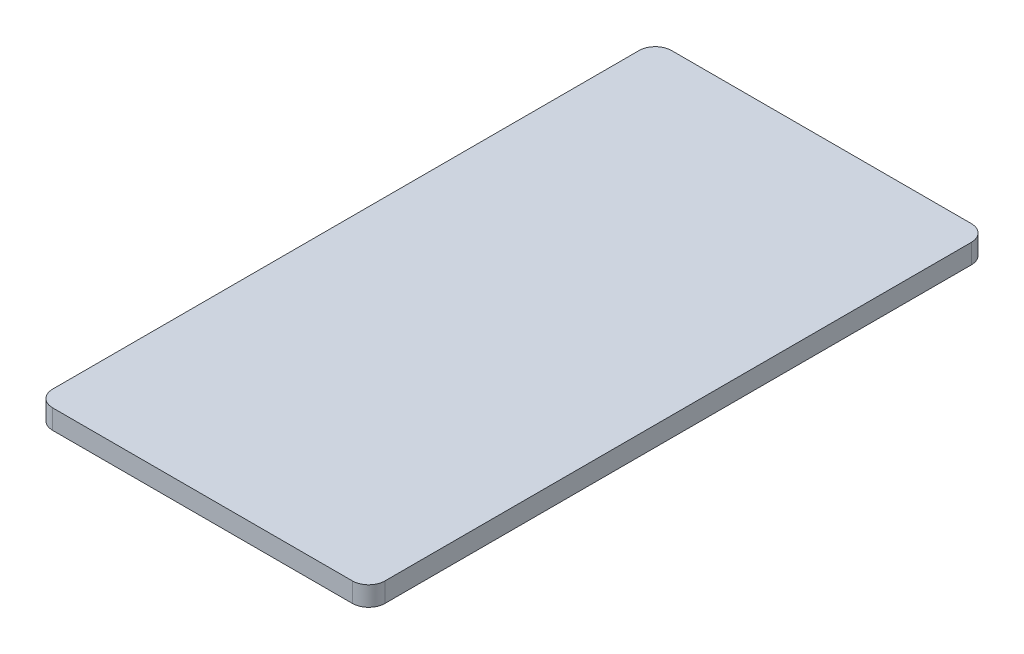
ISO-10303-21;
HEADER;
FILE_DESCRIPTION(('STEP AP214'),'2;1');
FILE_NAME('part.step','',(''),(''),'','','');
FILE_SCHEMA(('AUTOMOTIVE_DESIGN { 1 0 10303 214 1 1 1 1 }'));
ENDSEC;
DATA;
#1=APPLICATION_CONTEXT('core data for automotive mechanical design processes');
#2=APPLICATION_PROTOCOL_DEFINITION('international standard','automotive_design',2000,#1);
#3=PRODUCT_CONTEXT('',#1,'mechanical');
#4=PRODUCT('Part','Part','',(#3));
#5=PRODUCT_RELATED_PRODUCT_CATEGORY('part','',(#4));
#6=PRODUCT_DEFINITION_FORMATION('','',#4);
#7=PRODUCT_DEFINITION_CONTEXT('part definition',#1,'design');
#8=PRODUCT_DEFINITION('design','',#6,#7);
#9=PRODUCT_DEFINITION_SHAPE('','',#8);
#10=(LENGTH_UNIT() NAMED_UNIT(*) SI_UNIT(.MILLI.,.METRE.));
#11=(NAMED_UNIT(*) PLANE_ANGLE_UNIT() SI_UNIT($,.RADIAN.));
#12=(NAMED_UNIT(*) SI_UNIT($,.STERADIAN.) SOLID_ANGLE_UNIT());
#13=UNCERTAINTY_MEASURE_WITH_UNIT(LENGTH_MEASURE(1.E-05),#10,'distance_accuracy_value','');
#14=(GEOMETRIC_REPRESENTATION_CONTEXT(3) GLOBAL_UNCERTAINTY_ASSIGNED_CONTEXT((#13)) GLOBAL_UNIT_ASSIGNED_CONTEXT((#10,
#11,#12)) REPRESENTATION_CONTEXT('',''));
#15=CARTESIAN_POINT('',(0.,0.,0.));
#16=DIRECTION('',(0.,0.,1.));
#17=DIRECTION('',(1.,0.,0.));
#18=AXIS2_PLACEMENT_3D('',#15,#16,#17);
#19=CARTESIAN_POINT('',(9.4,3.8,-14.));
#20=DIRECTION('',(0.,-1.,0.));
#21=DIRECTION('',(0.,0.,-1.));
#22=AXIS2_PLACEMENT_3D('',#19,#20,#21);
#23=CYLINDRICAL_SURFACE('',#22,0.999999999999999);
#24=CARTESIAN_POINT('',(9.4,2.6,-14.));
#25=DIRECTION('',(0.,-1.,0.));
#26=DIRECTION('',(0.,0.,-1.));
#27=AXIS2_PLACEMENT_3D('',#24,#25,#26);
#28=CIRCLE('',#27,0.999999999999999);
#29=CARTESIAN_POINT('',(9.4,2.6,-15.));
#30=VERTEX_POINT('',#29);
#31=CARTESIAN_POINT('',(10.4,2.6,-14.));
#32=VERTEX_POINT('',#31);
#33=EDGE_CURVE('E132',#30,#32,#28,.T.);
#34=ORIENTED_EDGE('',*,*,#33,.F.);
#35=DIRECTION('',(0.,-1.,0.));
#36=VECTOR('',#35,1.);
#37=CARTESIAN_POINT('',(9.4,3.8,-15.));
#38=LINE('',#37,#36);
#39=CARTESIAN_POINT('',(9.4,3.8,-15.));
#40=VERTEX_POINT('',#39);
#41=EDGE_CURVE('E11',#40,#30,#38,.T.);
#42=ORIENTED_EDGE('',*,*,#41,.F.);
#43=CARTESIAN_POINT('',(9.4,3.8,-14.));
#44=DIRECTION('',(0.,-1.,0.));
#45=DIRECTION('',(0.,0.,-1.));
#46=AXIS2_PLACEMENT_3D('',#43,#44,#45);
#47=CIRCLE('',#46,0.999999999999999);
#48=CARTESIAN_POINT('',(10.4,3.8,-14.));
#49=VERTEX_POINT('',#48);
#50=EDGE_CURVE('E152',#40,#49,#47,.T.);
#51=ORIENTED_EDGE('',*,*,#50,.T.);
#52=DIRECTION('',(0.,-1.,0.));
#53=VECTOR('',#52,1.);
#54=CARTESIAN_POINT('',(10.4,3.8,-14.));
#55=LINE('',#54,#53);
#56=EDGE_CURVE('E38',#49,#32,#55,.T.);
#57=ORIENTED_EDGE('',*,*,#56,.T.);
#58=EDGE_LOOP('',(#34,#42,#51,#57));
#59=FACE_BOUND('',#58,.T.);
#60=ADVANCED_FACE('F35',(#59),#23,.T.);
#61=CARTESIAN_POINT('',(-9.,3.8,-15.));
#62=DIRECTION('',(0.,0.,-1.));
#63=DIRECTION('',(-1.,0.,0.));
#64=AXIS2_PLACEMENT_3D('',#61,#62,#63);
#65=PLANE('',#64);
#66=DIRECTION('',(1.,0.,0.));
#67=VECTOR('',#66,1.);
#68=CARTESIAN_POINT('',(-9.,2.6,-15.));
#69=LINE('',#68,#67);
#70=CARTESIAN_POINT('',(-9.,2.6,-15.));
#71=VERTEX_POINT('',#70);
#72=EDGE_CURVE('E150',#71,#30,#69,.T.);
#73=ORIENTED_EDGE('',*,*,#72,.F.);
#74=DIRECTION('',(0.,-1.,0.));
#75=VECTOR('',#74,1.);
#76=CARTESIAN_POINT('',(-9.,3.8,-15.));
#77=LINE('',#76,#75);
#78=CARTESIAN_POINT('',(-9.,3.8,-15.));
#79=VERTEX_POINT('',#78);
#80=EDGE_CURVE('E44',#79,#71,#77,.T.);
#81=ORIENTED_EDGE('',*,*,#80,.F.);
#82=DIRECTION('',(1.,0.,0.));
#83=VECTOR('',#82,1.);
#84=CARTESIAN_POINT('',(-9.,3.8,-15.));
#85=LINE('',#84,#83);
#86=EDGE_CURVE('E122',#79,#40,#85,.T.);
#87=ORIENTED_EDGE('',*,*,#86,.T.);
#88=ORIENTED_EDGE('',*,*,#41,.T.);
#89=EDGE_LOOP('',(#73,#81,#87,#88));
#90=FACE_BOUND('',#89,.T.);
#91=ADVANCED_FACE('F164',(#90),#65,.T.);
#92=CARTESIAN_POINT('',(-9.,3.8,-14.));
#93=DIRECTION('',(0.,-1.,0.));
#94=DIRECTION('',(0.,0.,-1.));
#95=AXIS2_PLACEMENT_3D('',#92,#93,#94);
#96=CYLINDRICAL_SURFACE('',#95,0.999999999999997);
#97=CARTESIAN_POINT('',(-9.,2.6,-14.));
#98=DIRECTION('',(0.,-1.,0.));
#99=DIRECTION('',(0.,0.,-1.));
#100=AXIS2_PLACEMENT_3D('',#97,#98,#99);
#101=CIRCLE('',#100,0.999999999999997);
#102=CARTESIAN_POINT('',(-10.,2.6,-14.));
#103=VERTEX_POINT('',#102);
#104=EDGE_CURVE('E109',#103,#71,#101,.T.);
#105=ORIENTED_EDGE('',*,*,#104,.F.);
#106=DIRECTION('',(0.,-1.,0.));
#107=VECTOR('',#106,1.);
#108=CARTESIAN_POINT('',(-10.,3.8,-14.));
#109=LINE('',#108,#107);
#110=CARTESIAN_POINT('',(-10.,3.8,-14.));
#111=VERTEX_POINT('',#110);
#112=EDGE_CURVE('E104',#111,#103,#109,.T.);
#113=ORIENTED_EDGE('',*,*,#112,.F.);
#114=CARTESIAN_POINT('',(-9.,3.8,-14.));
#115=DIRECTION('',(0.,-1.,0.));
#116=DIRECTION('',(0.,0.,-1.));
#117=AXIS2_PLACEMENT_3D('',#114,#115,#116);
#118=CIRCLE('',#117,0.999999999999997);
#119=EDGE_CURVE('E107',#111,#79,#118,.T.);
#120=ORIENTED_EDGE('',*,*,#119,.T.);
#121=ORIENTED_EDGE('',*,*,#80,.T.);
#122=EDGE_LOOP('',(#105,#113,#120,#121));
#123=FACE_BOUND('',#122,.T.);
#124=ADVANCED_FACE('F106',(#123),#96,.T.);
#125=CARTESIAN_POINT('',(-10.,3.8,22.));
#126=DIRECTION('',(-1.,0.,0.));
#127=DIRECTION('',(0.,0.,1.));
#128=AXIS2_PLACEMENT_3D('',#125,#126,#127);
#129=PLANE('',#128);
#130=DIRECTION('',(0.,0.,-1.));
#131=VECTOR('',#130,1.);
#132=CARTESIAN_POINT('',(-10.,2.6,22.));
#133=LINE('',#132,#131);
#134=CARTESIAN_POINT('',(-10.,2.6,22.));
#135=VERTEX_POINT('',#134);
#136=EDGE_CURVE('E147',#135,#103,#133,.T.);
#137=ORIENTED_EDGE('',*,*,#136,.F.);
#138=DIRECTION('',(0.,-1.,0.));
#139=VECTOR('',#138,1.);
#140=CARTESIAN_POINT('',(-10.,3.8,22.));
#141=LINE('',#140,#139);
#142=CARTESIAN_POINT('',(-10.,3.8,22.));
#143=VERTEX_POINT('',#142);
#144=EDGE_CURVE('E114',#143,#135,#141,.T.);
#145=ORIENTED_EDGE('',*,*,#144,.F.);
#146=DIRECTION('',(0.,0.,-1.));
#147=VECTOR('',#146,1.);
#148=CARTESIAN_POINT('',(-10.,3.8,22.));
#149=LINE('',#148,#147);
#150=EDGE_CURVE('E120',#143,#111,#149,.T.);
#151=ORIENTED_EDGE('',*,*,#150,.T.);
#152=ORIENTED_EDGE('',*,*,#112,.T.);
#153=EDGE_LOOP('',(#137,#145,#151,#152));
#154=FACE_BOUND('',#153,.T.);
#155=ADVANCED_FACE('F124',(#154),#129,.T.);
#156=CARTESIAN_POINT('',(-9.,3.8,22.));
#157=DIRECTION('',(0.,-1.,0.));
#158=DIRECTION('',(0.,0.,-1.));
#159=AXIS2_PLACEMENT_3D('',#156,#157,#158);
#160=CYLINDRICAL_SURFACE('',#159,1.);
#161=CARTESIAN_POINT('',(-9.,2.6,22.));
#162=DIRECTION('',(0.,-1.,0.));
#163=DIRECTION('',(0.,0.,-1.));
#164=AXIS2_PLACEMENT_3D('',#161,#162,#163);
#165=CIRCLE('',#164,1.);
#166=CARTESIAN_POINT('',(-9.,2.6,23.));
#167=VERTEX_POINT('',#166);
#168=EDGE_CURVE('E144',#167,#135,#165,.T.);
#169=ORIENTED_EDGE('',*,*,#168,.F.);
#170=DIRECTION('',(0.,-1.,0.));
#171=VECTOR('',#170,1.);
#172=CARTESIAN_POINT('',(-9.,3.8,23.));
#173=LINE('',#172,#171);
#174=CARTESIAN_POINT('',(-9.,3.8,23.));
#175=VERTEX_POINT('',#174);
#176=EDGE_CURVE('E156',#175,#167,#173,.T.);
#177=ORIENTED_EDGE('',*,*,#176,.F.);
#178=CARTESIAN_POINT('',(-9.,3.8,22.));
#179=DIRECTION('',(0.,-1.,0.));
#180=DIRECTION('',(0.,0.,-1.));
#181=AXIS2_PLACEMENT_3D('',#178,#179,#180);
#182=CIRCLE('',#181,1.);
#183=EDGE_CURVE('E125',#175,#143,#182,.T.);
#184=ORIENTED_EDGE('',*,*,#183,.T.);
#185=ORIENTED_EDGE('',*,*,#144,.T.);
#186=EDGE_LOOP('',(#169,#177,#184,#185));
#187=FACE_BOUND('',#186,.T.);
#188=ADVANCED_FACE('F177',(#187),#160,.T.);
#189=CARTESIAN_POINT('',(9.4,3.8,23.));
#190=DIRECTION('',(0.,0.,1.));
#191=DIRECTION('',(1.,0.,0.));
#192=AXIS2_PLACEMENT_3D('',#189,#190,#191);
#193=PLANE('',#192);
#194=DIRECTION('',(-1.,0.,0.));
#195=VECTOR('',#194,1.);
#196=CARTESIAN_POINT('',(9.4,2.6,23.));
#197=LINE('',#196,#195);
#198=CARTESIAN_POINT('',(9.4,2.6,23.));
#199=VERTEX_POINT('',#198);
#200=EDGE_CURVE('E141',#199,#167,#197,.T.);
#201=ORIENTED_EDGE('',*,*,#200,.F.);
#202=DIRECTION('',(0.,-1.,0.));
#203=VECTOR('',#202,1.);
#204=CARTESIAN_POINT('',(9.4,3.8,23.));
#205=LINE('',#204,#203);
#206=CARTESIAN_POINT('',(9.4,3.8,23.));
#207=VERTEX_POINT('',#206);
#208=EDGE_CURVE('E158',#207,#199,#205,.T.);
#209=ORIENTED_EDGE('',*,*,#208,.F.);
#210=DIRECTION('',(-1.,0.,0.));
#211=VECTOR('',#210,1.);
#212=CARTESIAN_POINT('',(9.4,3.8,23.));
#213=LINE('',#212,#211);
#214=EDGE_CURVE('E127',#207,#175,#213,.T.);
#215=ORIENTED_EDGE('',*,*,#214,.T.);
#216=ORIENTED_EDGE('',*,*,#176,.T.);
#217=EDGE_LOOP('',(#201,#209,#215,#216));
#218=FACE_BOUND('',#217,.T.);
#219=ADVANCED_FACE('F180',(#218),#193,.T.);
#220=CARTESIAN_POINT('',(9.4,3.8,22.));
#221=DIRECTION('',(0.,-1.,0.));
#222=DIRECTION('',(0.,0.,-1.));
#223=AXIS2_PLACEMENT_3D('',#220,#221,#222);
#224=CYLINDRICAL_SURFACE('',#223,1.);
#225=CARTESIAN_POINT('',(9.4,2.6,22.));
#226=DIRECTION('',(0.,-1.,0.));
#227=DIRECTION('',(0.,0.,-1.));
#228=AXIS2_PLACEMENT_3D('',#225,#226,#227);
#229=CIRCLE('',#228,1.);
#230=CARTESIAN_POINT('',(10.4,2.6,22.));
#231=VERTEX_POINT('',#230);
#232=EDGE_CURVE('E138',#231,#199,#229,.T.);
#233=ORIENTED_EDGE('',*,*,#232,.F.);
#234=DIRECTION('',(0.,-1.,0.));
#235=VECTOR('',#234,1.);
#236=CARTESIAN_POINT('',(10.4,3.8,22.));
#237=LINE('',#236,#235);
#238=CARTESIAN_POINT('',(10.4,3.8,22.));
#239=VERTEX_POINT('',#238);
#240=EDGE_CURVE('E159',#239,#231,#237,.T.);
#241=ORIENTED_EDGE('',*,*,#240,.F.);
#242=CARTESIAN_POINT('',(9.4,3.8,22.));
#243=DIRECTION('',(0.,-1.,0.));
#244=DIRECTION('',(0.,0.,-1.));
#245=AXIS2_PLACEMENT_3D('',#242,#243,#244);
#246=CIRCLE('',#245,1.);
#247=EDGE_CURVE('E255',#239,#207,#246,.T.);
#248=ORIENTED_EDGE('',*,*,#247,.T.);
#249=ORIENTED_EDGE('',*,*,#208,.T.);
#250=EDGE_LOOP('',(#233,#241,#248,#249));
#251=FACE_BOUND('',#250,.T.);
#252=ADVANCED_FACE('F184',(#251),#224,.T.);
#253=CARTESIAN_POINT('',(10.4,3.8,-14.));
#254=DIRECTION('',(1.,0.,0.));
#255=DIRECTION('',(0.,0.,-1.));
#256=AXIS2_PLACEMENT_3D('',#253,#254,#255);
#257=PLANE('',#256);
#258=DIRECTION('',(0.,0.,1.));
#259=VECTOR('',#258,1.);
#260=CARTESIAN_POINT('',(10.4,2.6,-14.));
#261=LINE('',#260,#259);
#262=EDGE_CURVE('E135',#32,#231,#261,.T.);
#263=ORIENTED_EDGE('',*,*,#262,.F.);
#264=ORIENTED_EDGE('',*,*,#56,.F.);
#265=DIRECTION('',(0.,0.,1.));
#266=VECTOR('',#265,1.);
#267=CARTESIAN_POINT('',(10.4,3.8,-14.));
#268=LINE('',#267,#266);
#269=EDGE_CURVE('E256',#49,#239,#268,.T.);
#270=ORIENTED_EDGE('',*,*,#269,.T.);
#271=ORIENTED_EDGE('',*,*,#240,.T.);
#272=EDGE_LOOP('',(#263,#264,#270,#271));
#273=FACE_BOUND('',#272,.T.);
#274=ADVANCED_FACE('F161',(#273),#257,.T.);
#275=CARTESIAN_POINT('',(9.4,3.8,-14.));
#276=DIRECTION('',(0.,-1.,0.));
#277=DIRECTION('',(0.,0.,-1.));
#278=AXIS2_PLACEMENT_3D('',#275,#276,#277);
#279=PLANE('',#278);
#280=ORIENTED_EDGE('',*,*,#50,.F.);
#281=ORIENTED_EDGE('',*,*,#86,.F.);
#282=ORIENTED_EDGE('',*,*,#119,.F.);
#283=ORIENTED_EDGE('',*,*,#150,.F.);
#284=ORIENTED_EDGE('',*,*,#183,.F.);
#285=ORIENTED_EDGE('',*,*,#214,.F.);
#286=ORIENTED_EDGE('',*,*,#247,.F.);
#287=ORIENTED_EDGE('',*,*,#269,.F.);
#288=EDGE_LOOP('',(#280,#281,#282,#283,#284,#285,#286,#287));
#289=FACE_BOUND('',#288,.T.);
#290=ADVANCED_FACE('F118',(#289),#279,.F.);
#291=CARTESIAN_POINT('',(9.4,2.6,-14.));
#292=DIRECTION('',(0.,-1.,0.));
#293=DIRECTION('',(0.,0.,-1.));
#294=AXIS2_PLACEMENT_3D('',#291,#292,#293);
#295=PLANE('',#294);
#296=ORIENTED_EDGE('',*,*,#33,.T.);
#297=ORIENTED_EDGE('',*,*,#262,.T.);
#298=ORIENTED_EDGE('',*,*,#232,.T.);
#299=ORIENTED_EDGE('',*,*,#200,.T.);
#300=ORIENTED_EDGE('',*,*,#168,.T.);
#301=ORIENTED_EDGE('',*,*,#136,.T.);
#302=ORIENTED_EDGE('',*,*,#104,.T.);
#303=ORIENTED_EDGE('',*,*,#72,.T.);
#304=EDGE_LOOP('',(#296,#297,#298,#299,#300,#301,#302,#303));
#305=FACE_BOUND('',#304,.T.);
#306=ADVANCED_FACE('F163',(#305),#295,.T.);
#307=CLOSED_SHELL('',(#60,#91,#124,#155,#188,#219,#252,#274,#290,#306));
#308=MANIFOLD_SOLID_BREP('B2',#307);
#309=ADVANCED_BREP_SHAPE_REPRESENTATION('',(#18,#308),#14);
#310=SHAPE_DEFINITION_REPRESENTATION(#9,#309);
ENDSEC;
END-ISO-10303-21;
